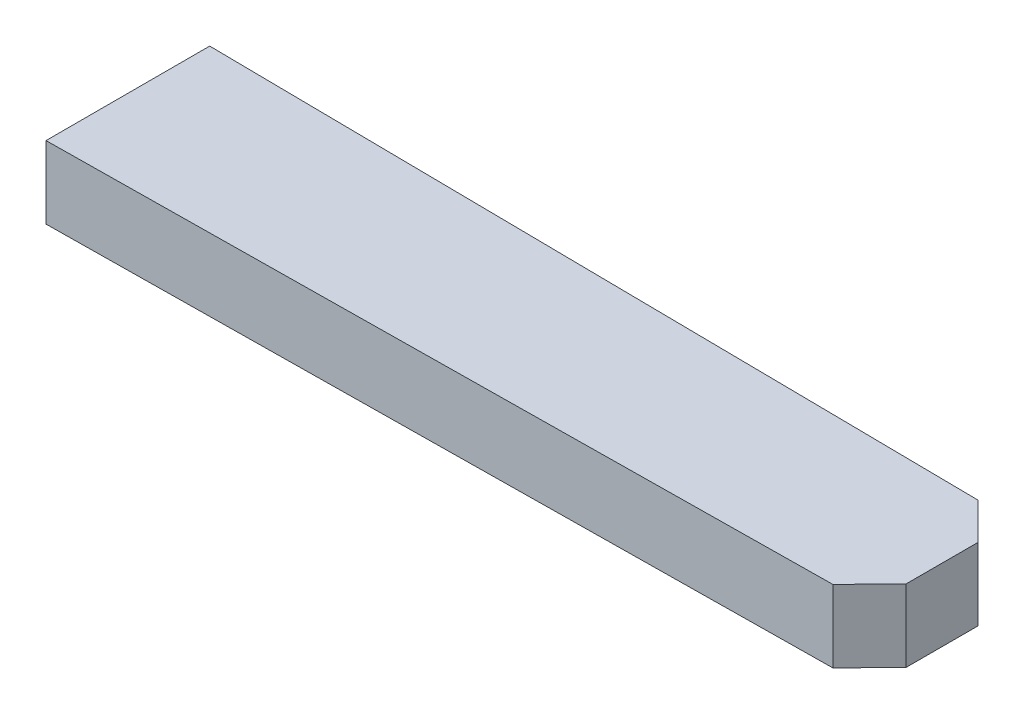
ISO-10303-21;
HEADER;
FILE_DESCRIPTION(('STEP AP214'),'2;1');
FILE_NAME('part.step','',(''),(''),'','','');
FILE_SCHEMA(('AUTOMOTIVE_DESIGN { 1 0 10303 214 1 1 1 1 }'));
ENDSEC;
DATA;
#1=APPLICATION_CONTEXT('core data for automotive mechanical design processes');
#2=APPLICATION_PROTOCOL_DEFINITION('international standard','automotive_design',2000,#1);
#3=PRODUCT_CONTEXT('',#1,'mechanical');
#4=PRODUCT('Part','Part','',(#3));
#5=PRODUCT_RELATED_PRODUCT_CATEGORY('part','',(#4));
#6=PRODUCT_DEFINITION_FORMATION('','',#4);
#7=PRODUCT_DEFINITION_CONTEXT('part definition',#1,'design');
#8=PRODUCT_DEFINITION('design','',#6,#7);
#9=PRODUCT_DEFINITION_SHAPE('','',#8);
#10=(LENGTH_UNIT() NAMED_UNIT(*) SI_UNIT(.MILLI.,.METRE.));
#11=(NAMED_UNIT(*) PLANE_ANGLE_UNIT() SI_UNIT($,.RADIAN.));
#12=(NAMED_UNIT(*) SI_UNIT($,.STERADIAN.) SOLID_ANGLE_UNIT());
#13=UNCERTAINTY_MEASURE_WITH_UNIT(LENGTH_MEASURE(1.E-05),#10,'distance_accuracy_value','');
#14=(GEOMETRIC_REPRESENTATION_CONTEXT(3) GLOBAL_UNCERTAINTY_ASSIGNED_CONTEXT((#13)) GLOBAL_UNIT_ASSIGNED_CONTEXT((#10,
#11,#12)) REPRESENTATION_CONTEXT('',''));
#15=CARTESIAN_POINT('',(0.,0.,0.));
#16=DIRECTION('',(0.,0.,1.));
#17=DIRECTION('',(1.,0.,0.));
#18=AXIS2_PLACEMENT_3D('',#15,#16,#17);
#19=CARTESIAN_POINT('',(0.,4.,-9.05));
#20=DIRECTION('',(1.,0.,0.));
#21=DIRECTION('',(0.,0.,-1.));
#22=AXIS2_PLACEMENT_3D('',#19,#20,#21);
#23=PLANE('',#22);
#24=DIRECTION('',(0.,0.,1.));
#25=VECTOR('',#24,1.);
#26=CARTESIAN_POINT('',(0.,0.,-9.05));
#27=LINE('',#26,#25);
#28=CARTESIAN_POINT('',(0.,0.,-9.05));
#29=VERTEX_POINT('',#28);
#30=CARTESIAN_POINT('',(0.,0.,0.));
#31=VERTEX_POINT('',#30);
#32=EDGE_CURVE('E112',#29,#31,#27,.T.);
#33=ORIENTED_EDGE('',*,*,#32,.T.);
#34=DIRECTION('',(0.,-1.,0.));
#35=VECTOR('',#34,1.);
#36=CARTESIAN_POINT('',(0.,4.,0.));
#37=LINE('',#36,#35);
#38=CARTESIAN_POINT('',(0.,4.,0.));
#39=VERTEX_POINT('',#38);
#40=EDGE_CURVE('E97',#39,#31,#37,.T.);
#41=ORIENTED_EDGE('',*,*,#40,.F.);
#42=DIRECTION('',(0.,0.,1.));
#43=VECTOR('',#42,1.);
#44=CARTESIAN_POINT('',(0.,4.,-9.05));
#45=LINE('',#44,#43);
#46=CARTESIAN_POINT('',(0.,4.,-9.05));
#47=VERTEX_POINT('',#46);
#48=EDGE_CURVE('E101',#47,#39,#45,.T.);
#49=ORIENTED_EDGE('',*,*,#48,.F.);
#50=DIRECTION('',(0.,-1.,0.));
#51=VECTOR('',#50,1.);
#52=CARTESIAN_POINT('',(0.,4.,-9.05));
#53=LINE('',#52,#51);
#54=EDGE_CURVE('E114',#47,#29,#53,.T.);
#55=ORIENTED_EDGE('',*,*,#54,.T.);
#56=EDGE_LOOP('',(#33,#41,#49,#55));
#57=FACE_BOUND('',#56,.T.);
#58=ADVANCED_FACE('F39',(#57),#23,.F.);
#59=CARTESIAN_POINT('',(45.,4.,-0.52500000000001));
#60=DIRECTION('',(-0.0116658727662285,0.,-0.999931951390995));
#61=DIRECTION('',(-0.999931951390995,0.,0.0116658727662285));
#62=AXIS2_PLACEMENT_3D('',#59,#60,#61);
#63=PLANE('',#62);
#64=DIRECTION('',(0.999931951390995,0.,-0.0116658727662285));
#65=VECTOR('',#64,1.);
#66=CARTESIAN_POINT('',(45.,0.,-0.52500000000001));
#67=LINE('',#66,#65);
#68=CARTESIAN_POINT('',(43.000136097218,0.,-0.501668254467553));
#69=VERTEX_POINT('',#68);
#70=EDGE_CURVE('E140',#31,#69,#67,.T.);
#71=ORIENTED_EDGE('',*,*,#70,.T.);
#72=DIRECTION('',(0.,1.,0.));
#73=VECTOR('',#72,1.);
#74=CARTESIAN_POINT('',(43.000136097218,4.,-0.501668254467553));
#75=LINE('',#74,#73);
#76=CARTESIAN_POINT('',(43.000136097218,4.,-0.501668254467553));
#77=VERTEX_POINT('',#76);
#78=EDGE_CURVE('E63',#69,#77,#75,.T.);
#79=ORIENTED_EDGE('',*,*,#78,.T.);
#80=DIRECTION('',(0.999931951390995,0.,-0.0116658727662285));
#81=VECTOR('',#80,1.);
#82=CARTESIAN_POINT('',(45.,4.,-0.52500000000001));
#83=LINE('',#82,#81);
#84=EDGE_CURVE('E93',#39,#77,#83,.T.);
#85=ORIENTED_EDGE('',*,*,#84,.F.);
#86=ORIENTED_EDGE('',*,*,#40,.T.);
#87=EDGE_LOOP('',(#71,#79,#85,#86));
#88=FACE_BOUND('',#87,.T.);
#89=ADVANCED_FACE('F95',(#88),#63,.F.);
#90=CARTESIAN_POINT('',(45.,4.,-8.52500000000001));
#91=DIRECTION('',(-1.,0.,0.));
#92=DIRECTION('',(0.,0.,1.));
#93=AXIS2_PLACEMENT_3D('',#90,#91,#92);
#94=PLANE('',#93);
#95=DIRECTION('',(0.,0.,-1.));
#96=VECTOR('',#95,1.);
#97=CARTESIAN_POINT('',(45.,4.,-8.52500000000001));
#98=LINE('',#97,#96);
#99=CARTESIAN_POINT('',(45.,4.,-2.54874648210443));
#100=VERTEX_POINT('',#99);
#101=CARTESIAN_POINT('',(45.,4.,-6.52500000000001));
#102=VERTEX_POINT('',#101);
#103=EDGE_CURVE('E100',#100,#102,#98,.T.);
#104=ORIENTED_EDGE('',*,*,#103,.F.);
#105=DIRECTION('',(0.,-1.,0.));
#106=VECTOR('',#105,1.);
#107=CARTESIAN_POINT('',(45.,4.,-2.54874648210443));
#108=LINE('',#107,#106);
#109=CARTESIAN_POINT('',(45.,0.,-2.54874648210443));
#110=VERTEX_POINT('',#109);
#111=EDGE_CURVE('E116',#100,#110,#108,.T.);
#112=ORIENTED_EDGE('',*,*,#111,.T.);
#113=DIRECTION('',(0.,0.,-1.));
#114=VECTOR('',#113,1.);
#115=CARTESIAN_POINT('',(45.,0.,-8.52500000000001));
#116=LINE('',#115,#114);
#117=CARTESIAN_POINT('',(45.,0.,-6.52500000000001));
#118=VERTEX_POINT('',#117);
#119=EDGE_CURVE('E141',#110,#118,#116,.T.);
#120=ORIENTED_EDGE('',*,*,#119,.T.);
#121=DIRECTION('',(0.,1.,0.));
#122=VECTOR('',#121,1.);
#123=CARTESIAN_POINT('',(45.,4.,-6.52500000000001));
#124=LINE('',#123,#122);
#125=EDGE_CURVE('E113',#118,#102,#124,.T.);
#126=ORIENTED_EDGE('',*,*,#125,.T.);
#127=EDGE_LOOP('',(#104,#112,#120,#126));
#128=FACE_BOUND('',#127,.T.);
#129=ADVANCED_FACE('F132',(#128),#94,.F.);
#130=CARTESIAN_POINT('',(0.,4.,-9.05));
#131=DIRECTION('',(-0.0116658727662281,0.,0.999931951390995));
#132=DIRECTION('',(0.999931951390995,0.,0.0116658727662281));
#133=AXIS2_PLACEMENT_3D('',#130,#131,#132);
#134=PLANE('',#133);
#135=DIRECTION('',(-0.999931951390995,0.,-0.0116658727662281));
#136=VECTOR('',#135,1.);
#137=CARTESIAN_POINT('',(0.,4.,-9.05));
#138=LINE('',#137,#136);
#139=CARTESIAN_POINT('',(42.9763912310287,4.,-8.54860876897134));
#140=VERTEX_POINT('',#139);
#141=EDGE_CURVE('E105',#140,#47,#138,.T.);
#142=ORIENTED_EDGE('',*,*,#141,.F.);
#143=DIRECTION('',(0.,-1.,0.));
#144=VECTOR('',#143,1.);
#145=CARTESIAN_POINT('',(42.9763912310287,4.,-8.54860876897134));
#146=LINE('',#145,#144);
#147=CARTESIAN_POINT('',(42.9763912310287,0.,-8.54860876897134));
#148=VERTEX_POINT('',#147);
#149=EDGE_CURVE('E11',#140,#148,#146,.T.);
#150=ORIENTED_EDGE('',*,*,#149,.T.);
#151=DIRECTION('',(-0.999931951390995,0.,-0.0116658727662281));
#152=VECTOR('',#151,1.);
#153=CARTESIAN_POINT('',(0.,0.,-9.05));
#154=LINE('',#153,#152);
#155=EDGE_CURVE('E109',#148,#29,#154,.T.);
#156=ORIENTED_EDGE('',*,*,#155,.T.);
#157=ORIENTED_EDGE('',*,*,#54,.F.);
#158=EDGE_LOOP('',(#142,#150,#156,#157));
#159=FACE_BOUND('',#158,.T.);
#160=ADVANCED_FACE('F148',(#159),#134,.F.);
#161=CARTESIAN_POINT('',(0.,4.,0.));
#162=DIRECTION('',(0.,-1.,0.));
#163=DIRECTION('',(0.,0.,-1.));
#164=AXIS2_PLACEMENT_3D('',#161,#162,#163);
#165=PLANE('',#164);
#166=ORIENTED_EDGE('',*,*,#84,.T.);
#167=DIRECTION('',(-0.698809645812211,0.,0.715307681295128));
#168=VECTOR('',#167,1.);
#169=CARTESIAN_POINT('',(45.,4.,-2.54874648210443));
#170=LINE('',#169,#168);
#171=EDGE_CURVE('E48',#77,#100,#170,.F.);
#172=ORIENTED_EDGE('',*,*,#171,.T.);
#173=ORIENTED_EDGE('',*,*,#103,.T.);
#174=DIRECTION('',(0.707106781186546,0.,0.707106781186549));
#175=VECTOR('',#174,1.);
#176=CARTESIAN_POINT('',(42.9763912310287,4.,-8.54860876897134));
#177=LINE('',#176,#175);
#178=EDGE_CURVE('E55',#102,#140,#177,.F.);
#179=ORIENTED_EDGE('',*,*,#178,.T.);
#180=ORIENTED_EDGE('',*,*,#141,.T.);
#181=ORIENTED_EDGE('',*,*,#48,.T.);
#182=EDGE_LOOP('',(#166,#172,#173,#179,#180,#181));
#183=FACE_BOUND('',#182,.T.);
#184=ADVANCED_FACE('F104',(#183),#165,.F.);
#185=CARTESIAN_POINT('',(0.,0.,0.));
#186=DIRECTION('',(0.,-1.,0.));
#187=DIRECTION('',(0.,0.,-1.));
#188=AXIS2_PLACEMENT_3D('',#185,#186,#187);
#189=PLANE('',#188);
#190=ORIENTED_EDGE('',*,*,#119,.F.);
#191=DIRECTION('',(0.698809645812211,0.,-0.715307681295128));
#192=VECTOR('',#191,1.);
#193=CARTESIAN_POINT('',(21.7509021758427,0.,21.2492339213752));
#194=LINE('',#193,#192);
#195=EDGE_CURVE('E125',#110,#69,#194,.F.);
#196=ORIENTED_EDGE('',*,*,#195,.T.);
#197=ORIENTED_EDGE('',*,*,#70,.F.);
#198=ORIENTED_EDGE('',*,*,#32,.F.);
#199=ORIENTED_EDGE('',*,*,#155,.F.);
#200=DIRECTION('',(-0.707106781186546,0.,-0.707106781186549));
#201=VECTOR('',#200,1.);
#202=CARTESIAN_POINT('',(25.7625000000001,0.,-25.7625));
#203=LINE('',#202,#201);
#204=EDGE_CURVE('E123',#148,#118,#203,.F.);
#205=ORIENTED_EDGE('',*,*,#204,.T.);
#206=EDGE_LOOP('',(#190,#196,#197,#198,#199,#205));
#207=FACE_BOUND('',#206,.T.);
#208=ADVANCED_FACE('F139',(#207),#189,.T.);
#209=CARTESIAN_POINT('',(45.,4.,-2.54874648210443));
#210=DIRECTION('',(-0.715307681295128,0.,-0.698809645812211));
#211=DIRECTION('',(0.,-1.,0.));
#212=AXIS2_PLACEMENT_3D('',#209,#210,#211);
#213=PLANE('',#212);
#214=ORIENTED_EDGE('',*,*,#171,.F.);
#215=ORIENTED_EDGE('',*,*,#78,.F.);
#216=ORIENTED_EDGE('',*,*,#195,.F.);
#217=ORIENTED_EDGE('',*,*,#111,.F.);
#218=EDGE_LOOP('',(#214,#215,#216,#217));
#219=FACE_BOUND('',#218,.T.);
#220=ADVANCED_FACE('F137',(#219),#213,.F.);
#221=CARTESIAN_POINT('',(42.9763912310287,4.,-8.54860876897134));
#222=DIRECTION('',(-0.707106781186549,0.,0.707106781186546));
#223=DIRECTION('',(0.,-1.,0.));
#224=AXIS2_PLACEMENT_3D('',#221,#222,#223);
#225=PLANE('',#224);
#226=ORIENTED_EDGE('',*,*,#178,.F.);
#227=ORIENTED_EDGE('',*,*,#125,.F.);
#228=ORIENTED_EDGE('',*,*,#204,.F.);
#229=ORIENTED_EDGE('',*,*,#149,.F.);
#230=EDGE_LOOP('',(#226,#227,#228,#229));
#231=FACE_BOUND('',#230,.T.);
#232=ADVANCED_FACE('F42',(#231),#225,.F.);
#233=CLOSED_SHELL('',(#58,#89,#129,#160,#184,#208,#220,#232));
#234=MANIFOLD_SOLID_BREP('B2',#233);
#235=ADVANCED_BREP_SHAPE_REPRESENTATION('',(#18,#234),#14);
#236=SHAPE_DEFINITION_REPRESENTATION(#9,#235);
ENDSEC;
END-ISO-10303-21;
